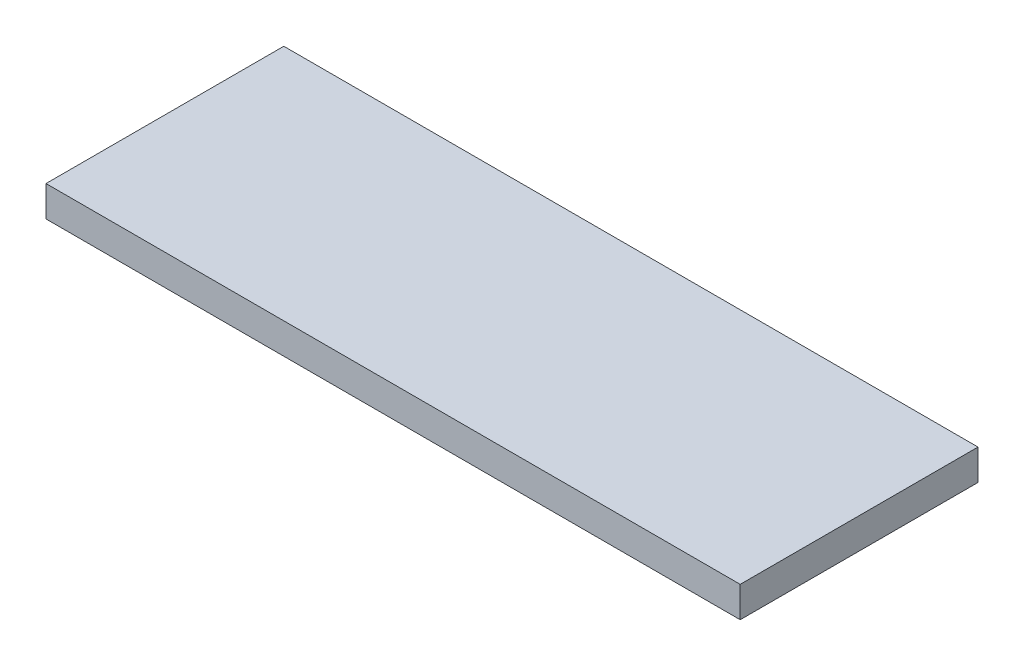
ISO-10303-21;
HEADER;
FILE_DESCRIPTION(('STEP AP214'),'2;1');
FILE_NAME('part.step','',(''),(''),'','','');
FILE_SCHEMA(('AUTOMOTIVE_DESIGN { 1 0 10303 214 1 1 1 1 }'));
ENDSEC;
DATA;
#1=APPLICATION_CONTEXT('core data for automotive mechanical design processes');
#2=APPLICATION_PROTOCOL_DEFINITION('international standard','automotive_design',2000,#1);
#3=PRODUCT_CONTEXT('',#1,'mechanical');
#4=PRODUCT('Part','Part','',(#3));
#5=PRODUCT_RELATED_PRODUCT_CATEGORY('part','',(#4));
#6=PRODUCT_DEFINITION_FORMATION('','',#4);
#7=PRODUCT_DEFINITION_CONTEXT('part definition',#1,'design');
#8=PRODUCT_DEFINITION('design','',#6,#7);
#9=PRODUCT_DEFINITION_SHAPE('','',#8);
#10=(LENGTH_UNIT() NAMED_UNIT(*) SI_UNIT(.MILLI.,.METRE.));
#11=(NAMED_UNIT(*) PLANE_ANGLE_UNIT() SI_UNIT($,.RADIAN.));
#12=(NAMED_UNIT(*) SI_UNIT($,.STERADIAN.) SOLID_ANGLE_UNIT());
#13=UNCERTAINTY_MEASURE_WITH_UNIT(LENGTH_MEASURE(1.E-05),#10,'distance_accuracy_value','');
#14=(GEOMETRIC_REPRESENTATION_CONTEXT(3) GLOBAL_UNCERTAINTY_ASSIGNED_CONTEXT((#13)) GLOBAL_UNIT_ASSIGNED_CONTEXT((#10,
#11,#12)) REPRESENTATION_CONTEXT('',''));
#15=CARTESIAN_POINT('',(0.,0.,0.));
#16=DIRECTION('',(0.,0.,1.));
#17=DIRECTION('',(1.,0.,0.));
#18=AXIS2_PLACEMENT_3D('',#15,#16,#17);
#19=CARTESIAN_POINT('',(0.,8.,0.));
#20=DIRECTION('',(0.,1.,0.));
#21=DIRECTION('',(0.,0.,1.));
#22=AXIS2_PLACEMENT_3D('',#19,#20,#21);
#23=PLANE('',#22);
#24=DIRECTION('',(-1.,0.,0.));
#25=VECTOR('',#24,1.);
#26=CARTESIAN_POINT('',(90.5,8.,-31.));
#27=LINE('',#26,#25);
#28=CARTESIAN_POINT('',(-90.5,8.,-31.));
#29=VERTEX_POINT('',#28);
#30=CARTESIAN_POINT('',(90.5,8.,-31.));
#31=VERTEX_POINT('',#30);
#32=EDGE_CURVE('E68',#29,#31,#27,.F.);
#33=ORIENTED_EDGE('',*,*,#32,.F.);
#34=DIRECTION('',(0.,0.,1.));
#35=VECTOR('',#34,1.);
#36=CARTESIAN_POINT('',(-90.5,8.,-31.));
#37=LINE('',#36,#35);
#38=CARTESIAN_POINT('',(-90.5,8.,31.));
#39=VERTEX_POINT('',#38);
#40=EDGE_CURVE('E20',#39,#29,#37,.F.);
#41=ORIENTED_EDGE('',*,*,#40,.F.);
#42=DIRECTION('',(1.,0.,0.));
#43=VECTOR('',#42,1.);
#44=CARTESIAN_POINT('',(-90.5,8.,31.));
#45=LINE('',#44,#43);
#46=CARTESIAN_POINT('',(90.5,8.,31.));
#47=VERTEX_POINT('',#46);
#48=EDGE_CURVE('E58',#47,#39,#45,.F.);
#49=ORIENTED_EDGE('',*,*,#48,.F.);
#50=DIRECTION('',(0.,0.,-1.));
#51=VECTOR('',#50,1.);
#52=CARTESIAN_POINT('',(90.5,8.,31.));
#53=LINE('',#52,#51);
#54=EDGE_CURVE('E53',#31,#47,#53,.F.);
#55=ORIENTED_EDGE('',*,*,#54,.F.);
#56=EDGE_LOOP('',(#33,#41,#49,#55));
#57=FACE_BOUND('',#56,.T.);
#58=ADVANCED_FACE('F17',(#57),#23,.T.);
#59=CARTESIAN_POINT('',(-90.5,0.,-31.));
#60=DIRECTION('',(-1.,0.,0.));
#61=DIRECTION('',(0.,0.,1.));
#62=AXIS2_PLACEMENT_3D('',#59,#60,#61);
#63=PLANE('',#62);
#64=DIRECTION('',(0.,1.,0.));
#65=VECTOR('',#64,1.);
#66=CARTESIAN_POINT('',(-90.5,0.,-31.));
#67=LINE('',#66,#65);
#68=CARTESIAN_POINT('',(-90.5,0.,-31.));
#69=VERTEX_POINT('',#68);
#70=EDGE_CURVE('E79',#69,#29,#67,.T.);
#71=ORIENTED_EDGE('',*,*,#70,.F.);
#72=DIRECTION('',(0.,0.,1.));
#73=VECTOR('',#72,1.);
#74=CARTESIAN_POINT('',(-90.5,0.,0.));
#75=LINE('',#74,#73);
#76=CARTESIAN_POINT('',(-90.5,0.,31.));
#77=VERTEX_POINT('',#76);
#78=EDGE_CURVE('E74',#69,#77,#75,.T.);
#79=ORIENTED_EDGE('',*,*,#78,.T.);
#80=DIRECTION('',(0.,1.,0.));
#81=VECTOR('',#80,1.);
#82=CARTESIAN_POINT('',(-90.5,0.,31.));
#83=LINE('',#82,#81);
#84=EDGE_CURVE('E63',#39,#77,#83,.F.);
#85=ORIENTED_EDGE('',*,*,#84,.F.);
#86=ORIENTED_EDGE('',*,*,#40,.T.);
#87=EDGE_LOOP('',(#71,#79,#85,#86));
#88=FACE_BOUND('',#87,.T.);
#89=ADVANCED_FACE('F73',(#88),#63,.T.);
#90=CARTESIAN_POINT('',(-90.5,0.,31.));
#91=DIRECTION('',(0.,0.,1.));
#92=DIRECTION('',(1.,0.,0.));
#93=AXIS2_PLACEMENT_3D('',#90,#91,#92);
#94=PLANE('',#93);
#95=ORIENTED_EDGE('',*,*,#84,.T.);
#96=DIRECTION('',(1.,0.,0.));
#97=VECTOR('',#96,1.);
#98=CARTESIAN_POINT('',(0.,0.,31.));
#99=LINE('',#98,#97);
#100=CARTESIAN_POINT('',(90.5,0.,31.));
#101=VERTEX_POINT('',#100);
#102=EDGE_CURVE('E84',#77,#101,#99,.T.);
#103=ORIENTED_EDGE('',*,*,#102,.T.);
#104=DIRECTION('',(0.,1.,0.));
#105=VECTOR('',#104,1.);
#106=CARTESIAN_POINT('',(90.5,0.,31.));
#107=LINE('',#106,#105);
#108=EDGE_CURVE('E65',#47,#101,#107,.F.);
#109=ORIENTED_EDGE('',*,*,#108,.F.);
#110=ORIENTED_EDGE('',*,*,#48,.T.);
#111=EDGE_LOOP('',(#95,#103,#109,#110));
#112=FACE_BOUND('',#111,.T.);
#113=ADVANCED_FACE('F60',(#112),#94,.T.);
#114=CARTESIAN_POINT('',(90.5,0.,31.));
#115=DIRECTION('',(1.,0.,0.));
#116=DIRECTION('',(0.,0.,-1.));
#117=AXIS2_PLACEMENT_3D('',#114,#115,#116);
#118=PLANE('',#117);
#119=ORIENTED_EDGE('',*,*,#108,.T.);
#120=DIRECTION('',(0.,0.,1.));
#121=VECTOR('',#120,1.);
#122=CARTESIAN_POINT('',(90.5,0.,0.));
#123=LINE('',#122,#121);
#124=CARTESIAN_POINT('',(90.5,0.,-31.));
#125=VERTEX_POINT('',#124);
#126=EDGE_CURVE('E26',#101,#125,#123,.F.);
#127=ORIENTED_EDGE('',*,*,#126,.T.);
#128=DIRECTION('',(0.,1.,0.));
#129=VECTOR('',#128,1.);
#130=CARTESIAN_POINT('',(90.5,0.,-31.));
#131=LINE('',#130,#129);
#132=EDGE_CURVE('E34',#31,#125,#131,.F.);
#133=ORIENTED_EDGE('',*,*,#132,.F.);
#134=ORIENTED_EDGE('',*,*,#54,.T.);
#135=EDGE_LOOP('',(#119,#127,#133,#134));
#136=FACE_BOUND('',#135,.T.);
#137=ADVANCED_FACE('F88',(#136),#118,.T.);
#138=CARTESIAN_POINT('',(90.5,0.,-31.));
#139=DIRECTION('',(0.,0.,-1.));
#140=DIRECTION('',(-1.,0.,0.));
#141=AXIS2_PLACEMENT_3D('',#138,#139,#140);
#142=PLANE('',#141);
#143=ORIENTED_EDGE('',*,*,#132,.T.);
#144=DIRECTION('',(1.,0.,0.));
#145=VECTOR('',#144,1.);
#146=CARTESIAN_POINT('',(0.,0.,-31.));
#147=LINE('',#146,#145);
#148=EDGE_CURVE('E11',#125,#69,#147,.F.);
#149=ORIENTED_EDGE('',*,*,#148,.T.);
#150=ORIENTED_EDGE('',*,*,#70,.T.);
#151=ORIENTED_EDGE('',*,*,#32,.T.);
#152=EDGE_LOOP('',(#143,#149,#150,#151));
#153=FACE_BOUND('',#152,.T.);
#154=ADVANCED_FACE('F91',(#153),#142,.T.);
#155=CARTESIAN_POINT('',(0.,0.,0.));
#156=DIRECTION('',(0.,1.,0.));
#157=DIRECTION('',(0.,0.,1.));
#158=AXIS2_PLACEMENT_3D('',#155,#156,#157);
#159=PLANE('',#158);
#160=ORIENTED_EDGE('',*,*,#126,.F.);
#161=ORIENTED_EDGE('',*,*,#102,.F.);
#162=ORIENTED_EDGE('',*,*,#78,.F.);
#163=ORIENTED_EDGE('',*,*,#148,.F.);
#164=EDGE_LOOP('',(#160,#161,#162,#163));
#165=FACE_BOUND('',#164,.T.);
#166=ADVANCED_FACE('F90',(#165),#159,.F.);
#167=CLOSED_SHELL('',(#58,#89,#113,#137,#154,#166));
#168=MANIFOLD_SOLID_BREP('B1',#167);
#169=ADVANCED_BREP_SHAPE_REPRESENTATION('',(#18,#168),#14);
#170=SHAPE_DEFINITION_REPRESENTATION(#9,#169);
ENDSEC;
END-ISO-10303-21;
